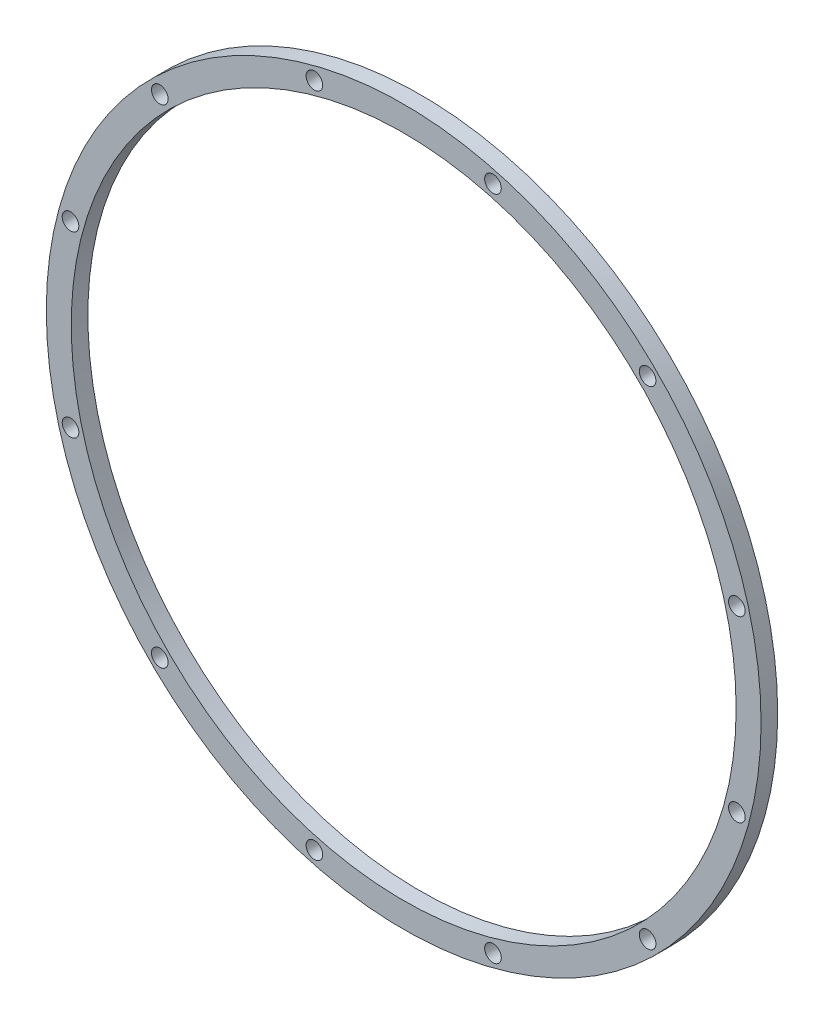
ISO-10303-21;
HEADER;
FILE_DESCRIPTION(('STEP AP214'),'2;1');
FILE_NAME('part.step','',(''),(''),'','','');
FILE_SCHEMA(('AUTOMOTIVE_DESIGN { 1 0 10303 214 1 1 1 1 }'));
ENDSEC;
DATA;
#1=APPLICATION_CONTEXT('core data for automotive mechanical design processes');
#2=APPLICATION_PROTOCOL_DEFINITION('international standard','automotive_design',2000,#1);
#3=PRODUCT_CONTEXT('',#1,'mechanical');
#4=PRODUCT('Part','Part','',(#3));
#5=PRODUCT_RELATED_PRODUCT_CATEGORY('part','',(#4));
#6=PRODUCT_DEFINITION_FORMATION('','',#4);
#7=PRODUCT_DEFINITION_CONTEXT('part definition',#1,'design');
#8=PRODUCT_DEFINITION('design','',#6,#7);
#9=PRODUCT_DEFINITION_SHAPE('','',#8);
#10=(LENGTH_UNIT() NAMED_UNIT(*) SI_UNIT(.MILLI.,.METRE.));
#11=(NAMED_UNIT(*) PLANE_ANGLE_UNIT() SI_UNIT($,.RADIAN.));
#12=(NAMED_UNIT(*) SI_UNIT($,.STERADIAN.) SOLID_ANGLE_UNIT());
#13=UNCERTAINTY_MEASURE_WITH_UNIT(LENGTH_MEASURE(1.E-05),#10,'distance_accuracy_value','');
#14=(GEOMETRIC_REPRESENTATION_CONTEXT(3) GLOBAL_UNCERTAINTY_ASSIGNED_CONTEXT((#13)) GLOBAL_UNIT_ASSIGNED_CONTEXT((#10,
#11,#12)) REPRESENTATION_CONTEXT('',''));
#15=CARTESIAN_POINT('',(0.,0.,0.));
#16=DIRECTION('',(0.,0.,1.));
#17=DIRECTION('',(1.,0.,0.));
#18=AXIS2_PLACEMENT_3D('',#15,#16,#17);
#19=CARTESIAN_POINT('',(0.,0.,25.4000508001016));
#20=DIRECTION('',(0.,0.,1.));
#21=DIRECTION('',(1.,0.,0.));
#22=AXIS2_PLACEMENT_3D('',#19,#20,#21);
#23=PLANE('',#22);
#24=CARTESIAN_POINT('',(136.410860404003,509.092261731953,25.4000508001016));
#25=DIRECTION('',(0.,0.,1.));
#26=DIRECTION('',(0.866025403784445,-0.499999999999989,0.));
#27=AXIS2_PLACEMENT_3D('',#24,#25,#26);
#28=CIRCLE('',#27,12.7);
#29=CARTESIAN_POINT('',(147.409383032066,502.742261731953,25.4000508001016));
#30=VERTEX_POINT('',#29);
#31=EDGE_CURVE('E62',#30,#30,#28,.T.);
#32=ORIENTED_EDGE('',*,*,#31,.F.);
#33=EDGE_LOOP('',(#32));
#34=FACE_BOUND('',#33,.T.);
#35=CARTESIAN_POINT('',(372.681401327936,372.681401327946,25.4000508001016));
#36=DIRECTION('',(0.,0.,1.));
#37=DIRECTION('',(0.50000000000001,-0.866025403784433,0.));
#38=AXIS2_PLACEMENT_3D('',#35,#36,#37);
#39=CIRCLE('',#38,12.7);
#40=CARTESIAN_POINT('',(379.031401327937,361.682878699883,25.4000508001016));
#41=VERTEX_POINT('',#40);
#42=EDGE_CURVE('E68',#41,#41,#39,.T.);
#43=ORIENTED_EDGE('',*,*,#42,.F.);
#44=EDGE_LOOP('',(#43));
#45=FACE_BOUND('',#44,.T.);
#46=CARTESIAN_POINT('',(509.09226173195,136.410860404016,25.4000508001016));
#47=DIRECTION('',(0.,0.,1.));
#48=DIRECTION('',(0.,-1.,0.));
#49=AXIS2_PLACEMENT_3D('',#46,#47,#48);
#50=CIRCLE('',#49,12.7);
#51=CARTESIAN_POINT('',(509.09226173195,123.710860404016,25.4000508001016));
#52=VERTEX_POINT('',#51);
#53=EDGE_CURVE('E74',#52,#52,#50,.T.);
#54=ORIENTED_EDGE('',*,*,#53,.F.);
#55=EDGE_LOOP('',(#54));
#56=FACE_BOUND('',#55,.T.);
#57=CARTESIAN_POINT('',(509.092261731953,-136.410860404005,25.4000508001016));
#58=DIRECTION('',(0.,0.,1.));
#59=DIRECTION('',(-0.499999999999992,-0.866025403784443,0.));
#60=AXIS2_PLACEMENT_3D('',#57,#58,#59);
#61=CIRCLE('',#60,12.7);
#62=CARTESIAN_POINT('',(502.742261731953,-147.409383032067,25.4000508001016));
#63=VERTEX_POINT('',#62);
#64=EDGE_CURVE('E80',#63,#63,#61,.T.);
#65=ORIENTED_EDGE('',*,*,#64,.F.);
#66=EDGE_LOOP('',(#65));
#67=FACE_BOUND('',#66,.T.);
#68=CARTESIAN_POINT('',(372.681401327944,-372.681401327938,25.4000508001016));
#69=DIRECTION('',(0.,0.,1.));
#70=DIRECTION('',(-0.866025403784435,-0.500000000000007,0.));
#71=AXIS2_PLACEMENT_3D('',#68,#69,#70);
#72=CIRCLE('',#71,12.7);
#73=CARTESIAN_POINT('',(361.682878699882,-379.031401327938,25.4000508001016));
#74=VERTEX_POINT('',#73);
#75=EDGE_CURVE('E86',#74,#74,#72,.T.);
#76=ORIENTED_EDGE('',*,*,#75,.F.);
#77=EDGE_LOOP('',(#76));
#78=FACE_BOUND('',#77,.T.);
#79=CARTESIAN_POINT('',(136.410860404011,-509.092261731951,25.4000508001016));
#80=DIRECTION('',(0.,0.,1.));
#81=DIRECTION('',(-1.,0.,0.));
#82=AXIS2_PLACEMENT_3D('',#79,#80,#81);
#83=CIRCLE('',#82,12.7);
#84=CARTESIAN_POINT('',(123.710860404011,-509.092261731951,25.4000508001016));
#85=VERTEX_POINT('',#84);
#86=EDGE_CURVE('E92',#85,#85,#83,.T.);
#87=ORIENTED_EDGE('',*,*,#86,.F.);
#88=EDGE_LOOP('',(#87));
#89=FACE_BOUND('',#88,.T.);
#90=CARTESIAN_POINT('',(-136.410860404007,-509.092261731952,25.4000508001016));
#91=DIRECTION('',(0.,0.,1.));
#92=DIRECTION('',(-0.866025403784442,0.499999999999995,0.));
#93=AXIS2_PLACEMENT_3D('',#90,#91,#92);
#94=CIRCLE('',#93,12.7);
#95=CARTESIAN_POINT('',(-147.409383032069,-502.742261731952,25.4000508001016));
#96=VERTEX_POINT('',#95);
#97=EDGE_CURVE('E98',#96,#96,#94,.T.);
#98=ORIENTED_EDGE('',*,*,#97,.F.);
#99=EDGE_LOOP('',(#98));
#100=FACE_BOUND('',#99,.T.);
#101=CARTESIAN_POINT('',(-372.681401327939,-372.681401327943,25.4000508001016));
#102=DIRECTION('',(0.,0.,1.));
#103=DIRECTION('',(-0.500000000000004,0.866025403784436,0.));
#104=AXIS2_PLACEMENT_3D('',#101,#102,#103);
#105=CIRCLE('',#104,12.7);
#106=CARTESIAN_POINT('',(-379.031401327939,-361.682878699881,25.4000508001016));
#107=VERTEX_POINT('',#106);
#108=EDGE_CURVE('E104',#107,#107,#105,.T.);
#109=ORIENTED_EDGE('',*,*,#108,.F.);
#110=EDGE_LOOP('',(#109));
#111=FACE_BOUND('',#110,.T.);
#112=CARTESIAN_POINT('',(-509.092261731951,-136.410860404012,25.4000508001016));
#113=DIRECTION('',(0.,0.,1.));
#114=DIRECTION('',(0.,1.,0.));
#115=AXIS2_PLACEMENT_3D('',#112,#113,#114);
#116=CIRCLE('',#115,12.7);
#117=CARTESIAN_POINT('',(-509.092261731951,-123.710860404012,25.4000508001016));
#118=VERTEX_POINT('',#117);
#119=EDGE_CURVE('E110',#118,#118,#116,.T.);
#120=ORIENTED_EDGE('',*,*,#119,.F.);
#121=EDGE_LOOP('',(#120));
#122=FACE_BOUND('',#121,.T.);
#123=CARTESIAN_POINT('',(-509.092261731952,136.410860404008,25.4000508001016));
#124=DIRECTION('',(0.,0.,1.));
#125=DIRECTION('',(0.499999999999998,0.86602540378444,0.));
#126=AXIS2_PLACEMENT_3D('',#123,#124,#125);
#127=CIRCLE('',#126,12.7);
#128=CARTESIAN_POINT('',(-502.742261731952,147.409383032071,25.4000508001016));
#129=VERTEX_POINT('',#128);
#130=EDGE_CURVE('E116',#129,#129,#127,.T.);
#131=ORIENTED_EDGE('',*,*,#130,.F.);
#132=EDGE_LOOP('',(#131));
#133=FACE_BOUND('',#132,.T.);
#134=CARTESIAN_POINT('',(-372.681401327942,372.68140132794,25.4000508001016));
#135=DIRECTION('',(0.,0.,1.));
#136=DIRECTION('',(0.866025403784438,0.500000000000001,0.));
#137=AXIS2_PLACEMENT_3D('',#134,#135,#136);
#138=CIRCLE('',#137,12.7);
#139=CARTESIAN_POINT('',(-361.682878699879,379.03140132794,25.4000508001016));
#140=VERTEX_POINT('',#139);
#141=EDGE_CURVE('E56',#140,#140,#138,.T.);
#142=ORIENTED_EDGE('',*,*,#141,.F.);
#143=EDGE_LOOP('',(#142));
#144=FACE_BOUND('',#143,.T.);
#145=CARTESIAN_POINT('',(-136.410860404011,509.092261731951,25.4000508001016));
#146=DIRECTION('',(0.,0.,1.));
#147=DIRECTION('',(1.,0.,0.));
#148=AXIS2_PLACEMENT_3D('',#145,#146,#147);
#149=CIRCLE('',#148,12.7);
#150=CARTESIAN_POINT('',(-123.710860404011,509.092261731951,25.4000508001016));
#151=VERTEX_POINT('',#150);
#152=EDGE_CURVE('E50',#151,#151,#149,.T.);
#153=ORIENTED_EDGE('',*,*,#152,.F.);
#154=EDGE_LOOP('',(#153));
#155=FACE_BOUND('',#154,.T.);
#156=CARTESIAN_POINT('',(0.,0.,25.4000508001016));
#157=DIRECTION('',(0.,0.,1.));
#158=DIRECTION('',(1.,0.,0.));
#159=AXIS2_PLACEMENT_3D('',#156,#157,#158);
#160=CIRCLE('',#159,546.101092202185);
#161=CARTESIAN_POINT('',(546.101092202185,0.,25.4000508001016));
#162=VERTEX_POINT('',#161);
#163=EDGE_CURVE('E10',#162,#162,#160,.T.);
#164=ORIENTED_EDGE('',*,*,#163,.T.);
#165=EDGE_LOOP('',(#164));
#166=FACE_BOUND('',#165,.T.);
#167=CARTESIAN_POINT('',(0.,0.,25.4000508001016));
#168=DIRECTION('',(0.,0.,1.));
#169=DIRECTION('',(1.,0.,0.));
#170=AXIS2_PLACEMENT_3D('',#167,#168,#169);
#171=CIRCLE('',#170,508.001016002032);
#172=CARTESIAN_POINT('',(508.001016002032,0.,25.4000508001016));
#173=VERTEX_POINT('',#172);
#174=EDGE_CURVE('E42',#173,#173,#171,.T.);
#175=ORIENTED_EDGE('',*,*,#174,.F.);
#176=EDGE_LOOP('',(#175));
#177=FACE_BOUND('',#176,.T.);
#178=ADVANCED_FACE('F31',(#34,#45,#56,#67,#78,#89,#100,#111,#122,#133,#144,#155,#166,#177),#23,.T.);
#179=CARTESIAN_POINT('',(0.,0.,0.));
#180=DIRECTION('',(0.,0.,1.));
#181=DIRECTION('',(1.,0.,0.));
#182=AXIS2_PLACEMENT_3D('',#179,#180,#181);
#183=PLANE('',#182);
#184=CARTESIAN_POINT('',(136.410860404003,509.092261731953,0.));
#185=DIRECTION('',(0.,0.,1.));
#186=DIRECTION('',(0.866025403784445,-0.499999999999989,0.));
#187=AXIS2_PLACEMENT_3D('',#184,#185,#186);
#188=CIRCLE('',#187,12.7);
#189=CARTESIAN_POINT('',(147.409383032066,502.742261731953,0.));
#190=VERTEX_POINT('',#189);
#191=EDGE_CURVE('E65',#190,#190,#188,.T.);
#192=ORIENTED_EDGE('',*,*,#191,.T.);
#193=EDGE_LOOP('',(#192));
#194=FACE_BOUND('',#193,.T.);
#195=CARTESIAN_POINT('',(372.681401327936,372.681401327946,0.));
#196=DIRECTION('',(0.,0.,1.));
#197=DIRECTION('',(0.50000000000001,-0.866025403784433,0.));
#198=AXIS2_PLACEMENT_3D('',#195,#196,#197);
#199=CIRCLE('',#198,12.7);
#200=CARTESIAN_POINT('',(379.031401327937,361.682878699883,0.));
#201=VERTEX_POINT('',#200);
#202=EDGE_CURVE('E71',#201,#201,#199,.T.);
#203=ORIENTED_EDGE('',*,*,#202,.T.);
#204=EDGE_LOOP('',(#203));
#205=FACE_BOUND('',#204,.T.);
#206=CARTESIAN_POINT('',(509.09226173195,136.410860404016,0.));
#207=DIRECTION('',(0.,0.,1.));
#208=DIRECTION('',(0.,-1.,0.));
#209=AXIS2_PLACEMENT_3D('',#206,#207,#208);
#210=CIRCLE('',#209,12.7);
#211=CARTESIAN_POINT('',(509.09226173195,123.710860404016,0.));
#212=VERTEX_POINT('',#211);
#213=EDGE_CURVE('E77',#212,#212,#210,.T.);
#214=ORIENTED_EDGE('',*,*,#213,.T.);
#215=EDGE_LOOP('',(#214));
#216=FACE_BOUND('',#215,.T.);
#217=CARTESIAN_POINT('',(509.092261731953,-136.410860404005,0.));
#218=DIRECTION('',(0.,0.,1.));
#219=DIRECTION('',(-0.499999999999992,-0.866025403784443,0.));
#220=AXIS2_PLACEMENT_3D('',#217,#218,#219);
#221=CIRCLE('',#220,12.7);
#222=CARTESIAN_POINT('',(502.742261731953,-147.409383032067,0.));
#223=VERTEX_POINT('',#222);
#224=EDGE_CURVE('E83',#223,#223,#221,.T.);
#225=ORIENTED_EDGE('',*,*,#224,.T.);
#226=EDGE_LOOP('',(#225));
#227=FACE_BOUND('',#226,.T.);
#228=CARTESIAN_POINT('',(372.681401327944,-372.681401327938,0.));
#229=DIRECTION('',(0.,0.,1.));
#230=DIRECTION('',(-0.866025403784435,-0.500000000000007,0.));
#231=AXIS2_PLACEMENT_3D('',#228,#229,#230);
#232=CIRCLE('',#231,12.7);
#233=CARTESIAN_POINT('',(361.682878699882,-379.031401327938,0.));
#234=VERTEX_POINT('',#233);
#235=EDGE_CURVE('E89',#234,#234,#232,.T.);
#236=ORIENTED_EDGE('',*,*,#235,.T.);
#237=EDGE_LOOP('',(#236));
#238=FACE_BOUND('',#237,.T.);
#239=CARTESIAN_POINT('',(136.410860404011,-509.092261731951,0.));
#240=DIRECTION('',(0.,0.,1.));
#241=DIRECTION('',(-1.,0.,0.));
#242=AXIS2_PLACEMENT_3D('',#239,#240,#241);
#243=CIRCLE('',#242,12.7);
#244=CARTESIAN_POINT('',(123.710860404011,-509.092261731951,0.));
#245=VERTEX_POINT('',#244);
#246=EDGE_CURVE('E95',#245,#245,#243,.T.);
#247=ORIENTED_EDGE('',*,*,#246,.T.);
#248=EDGE_LOOP('',(#247));
#249=FACE_BOUND('',#248,.T.);
#250=CARTESIAN_POINT('',(-136.410860404007,-509.092261731952,0.));
#251=DIRECTION('',(0.,0.,1.));
#252=DIRECTION('',(-0.866025403784442,0.499999999999995,0.));
#253=AXIS2_PLACEMENT_3D('',#250,#251,#252);
#254=CIRCLE('',#253,12.7);
#255=CARTESIAN_POINT('',(-147.409383032069,-502.742261731952,0.));
#256=VERTEX_POINT('',#255);
#257=EDGE_CURVE('E101',#256,#256,#254,.T.);
#258=ORIENTED_EDGE('',*,*,#257,.T.);
#259=EDGE_LOOP('',(#258));
#260=FACE_BOUND('',#259,.T.);
#261=CARTESIAN_POINT('',(-372.681401327939,-372.681401327943,0.));
#262=DIRECTION('',(0.,0.,1.));
#263=DIRECTION('',(-0.500000000000004,0.866025403784436,0.));
#264=AXIS2_PLACEMENT_3D('',#261,#262,#263);
#265=CIRCLE('',#264,12.7);
#266=CARTESIAN_POINT('',(-379.031401327939,-361.682878699881,0.));
#267=VERTEX_POINT('',#266);
#268=EDGE_CURVE('E107',#267,#267,#265,.T.);
#269=ORIENTED_EDGE('',*,*,#268,.T.);
#270=EDGE_LOOP('',(#269));
#271=FACE_BOUND('',#270,.T.);
#272=CARTESIAN_POINT('',(-509.092261731951,-136.410860404012,0.));
#273=DIRECTION('',(0.,0.,1.));
#274=DIRECTION('',(0.,1.,0.));
#275=AXIS2_PLACEMENT_3D('',#272,#273,#274);
#276=CIRCLE('',#275,12.7);
#277=CARTESIAN_POINT('',(-509.092261731951,-123.710860404012,0.));
#278=VERTEX_POINT('',#277);
#279=EDGE_CURVE('E113',#278,#278,#276,.T.);
#280=ORIENTED_EDGE('',*,*,#279,.T.);
#281=EDGE_LOOP('',(#280));
#282=FACE_BOUND('',#281,.T.);
#283=CARTESIAN_POINT('',(-509.092261731952,136.410860404008,0.));
#284=DIRECTION('',(0.,0.,1.));
#285=DIRECTION('',(0.499999999999998,0.86602540378444,0.));
#286=AXIS2_PLACEMENT_3D('',#283,#284,#285);
#287=CIRCLE('',#286,12.7);
#288=CARTESIAN_POINT('',(-502.742261731952,147.409383032071,0.));
#289=VERTEX_POINT('',#288);
#290=EDGE_CURVE('E59',#289,#289,#287,.T.);
#291=ORIENTED_EDGE('',*,*,#290,.T.);
#292=EDGE_LOOP('',(#291));
#293=FACE_BOUND('',#292,.T.);
#294=CARTESIAN_POINT('',(-372.681401327942,372.68140132794,0.));
#295=DIRECTION('',(0.,0.,1.));
#296=DIRECTION('',(0.866025403784438,0.500000000000001,0.));
#297=AXIS2_PLACEMENT_3D('',#294,#295,#296);
#298=CIRCLE('',#297,12.7);
#299=CARTESIAN_POINT('',(-361.682878699879,379.03140132794,0.));
#300=VERTEX_POINT('',#299);
#301=EDGE_CURVE('E53',#300,#300,#298,.T.);
#302=ORIENTED_EDGE('',*,*,#301,.T.);
#303=EDGE_LOOP('',(#302));
#304=FACE_BOUND('',#303,.T.);
#305=CARTESIAN_POINT('',(-136.410860404011,509.092261731951,0.));
#306=DIRECTION('',(0.,0.,1.));
#307=DIRECTION('',(1.,0.,0.));
#308=AXIS2_PLACEMENT_3D('',#305,#306,#307);
#309=CIRCLE('',#308,12.7);
#310=CARTESIAN_POINT('',(-123.710860404011,509.092261731951,0.));
#311=VERTEX_POINT('',#310);
#312=EDGE_CURVE('E47',#311,#311,#309,.T.);
#313=ORIENTED_EDGE('',*,*,#312,.T.);
#314=EDGE_LOOP('',(#313));
#315=FACE_BOUND('',#314,.T.);
#316=CARTESIAN_POINT('',(0.,0.,0.));
#317=DIRECTION('',(0.,0.,1.));
#318=DIRECTION('',(1.,0.,0.));
#319=AXIS2_PLACEMENT_3D('',#316,#317,#318);
#320=CIRCLE('',#319,546.101092202185);
#321=CARTESIAN_POINT('',(546.101092202185,0.,0.));
#322=VERTEX_POINT('',#321);
#323=EDGE_CURVE('E35',#322,#322,#320,.T.);
#324=ORIENTED_EDGE('',*,*,#323,.F.);
#325=EDGE_LOOP('',(#324));
#326=FACE_BOUND('',#325,.T.);
#327=CARTESIAN_POINT('',(0.,0.,0.));
#328=DIRECTION('',(0.,0.,1.));
#329=DIRECTION('',(1.,0.,0.));
#330=AXIS2_PLACEMENT_3D('',#327,#328,#329);
#331=CIRCLE('',#330,508.001016002032);
#332=CARTESIAN_POINT('',(508.001016002032,0.,0.));
#333=VERTEX_POINT('',#332);
#334=EDGE_CURVE('E44',#333,#333,#331,.T.);
#335=ORIENTED_EDGE('',*,*,#334,.T.);
#336=EDGE_LOOP('',(#335));
#337=FACE_BOUND('',#336,.T.);
#338=ADVANCED_FACE('F122',(#194,#205,#216,#227,#238,#249,#260,#271,#282,#293,#304,#315,#326,
#337),#183,.F.);
#339=CARTESIAN_POINT('',(0.,0.,25.4000508001016));
#340=DIRECTION('',(0.,0.,-1.));
#341=DIRECTION('',(-1.,0.,0.));
#342=AXIS2_PLACEMENT_3D('',#339,#340,#341);
#343=CYLINDRICAL_SURFACE('',#342,546.101092202185);
#344=ORIENTED_EDGE('',*,*,#163,.F.);
#345=EDGE_LOOP('',(#344));
#346=FACE_BOUND('',#345,.T.);
#347=ORIENTED_EDGE('',*,*,#323,.T.);
#348=EDGE_LOOP('',(#347));
#349=FACE_BOUND('',#348,.T.);
#350=ADVANCED_FACE('F33',(#346,#349),#343,.T.);
#351=CARTESIAN_POINT('',(0.,0.,25.4000508001016));
#352=DIRECTION('',(0.,0.,-1.));
#353=DIRECTION('',(-1.,0.,0.));
#354=AXIS2_PLACEMENT_3D('',#351,#352,#353);
#355=CYLINDRICAL_SURFACE('',#354,508.001016002032);
#356=ORIENTED_EDGE('',*,*,#174,.T.);
#357=EDGE_LOOP('',(#356));
#358=FACE_BOUND('',#357,.T.);
#359=ORIENTED_EDGE('',*,*,#334,.F.);
#360=EDGE_LOOP('',(#359));
#361=FACE_BOUND('',#360,.T.);
#362=ADVANCED_FACE('F143',(#358,#361),#355,.F.);
#363=CARTESIAN_POINT('',(-136.410860404011,509.092261731951,0.));
#364=DIRECTION('',(0.,0.,1.));
#365=DIRECTION('',(1.,0.,0.));
#366=AXIS2_PLACEMENT_3D('',#363,#364,#365);
#367=CYLINDRICAL_SURFACE('',#366,12.7);
#368=ORIENTED_EDGE('',*,*,#312,.F.);
#369=EDGE_LOOP('',(#368));
#370=FACE_BOUND('',#369,.T.);
#371=ORIENTED_EDGE('',*,*,#152,.T.);
#372=EDGE_LOOP('',(#371));
#373=FACE_BOUND('',#372,.T.);
#374=ADVANCED_FACE('F146',(#370,#373),#367,.F.);
#375=CARTESIAN_POINT('',(-372.681401327942,372.68140132794,0.));
#376=DIRECTION('',(0.,0.,1.));
#377=DIRECTION('',(1.,0.,0.));
#378=AXIS2_PLACEMENT_3D('',#375,#376,#377);
#379=CYLINDRICAL_SURFACE('',#378,12.7);
#380=ORIENTED_EDGE('',*,*,#301,.F.);
#381=EDGE_LOOP('',(#380));
#382=FACE_BOUND('',#381,.T.);
#383=ORIENTED_EDGE('',*,*,#141,.T.);
#384=EDGE_LOOP('',(#383));
#385=FACE_BOUND('',#384,.T.);
#386=ADVANCED_FACE('F129',(#382,#385),#379,.F.);
#387=CARTESIAN_POINT('',(-509.092261731952,136.410860404008,0.));
#388=DIRECTION('',(0.,0.,1.));
#389=DIRECTION('',(1.,0.,0.));
#390=AXIS2_PLACEMENT_3D('',#387,#388,#389);
#391=CYLINDRICAL_SURFACE('',#390,12.7);
#392=ORIENTED_EDGE('',*,*,#290,.F.);
#393=EDGE_LOOP('',(#392));
#394=FACE_BOUND('',#393,.T.);
#395=ORIENTED_EDGE('',*,*,#130,.T.);
#396=EDGE_LOOP('',(#395));
#397=FACE_BOUND('',#396,.T.);
#398=ADVANCED_FACE('F125',(#394,#397),#391,.F.);
#399=CARTESIAN_POINT('',(-509.092261731951,-136.410860404012,0.));
#400=DIRECTION('',(0.,0.,1.));
#401=DIRECTION('',(1.,0.,0.));
#402=AXIS2_PLACEMENT_3D('',#399,#400,#401);
#403=CYLINDRICAL_SURFACE('',#402,12.7);
#404=ORIENTED_EDGE('',*,*,#279,.F.);
#405=EDGE_LOOP('',(#404));
#406=FACE_BOUND('',#405,.T.);
#407=ORIENTED_EDGE('',*,*,#119,.T.);
#408=EDGE_LOOP('',(#407));
#409=FACE_BOUND('',#408,.T.);
#410=ADVANCED_FACE('F128',(#406,#409),#403,.F.);
#411=CARTESIAN_POINT('',(-372.681401327939,-372.681401327943,0.));
#412=DIRECTION('',(0.,0.,1.));
#413=DIRECTION('',(1.,0.,0.));
#414=AXIS2_PLACEMENT_3D('',#411,#412,#413);
#415=CYLINDRICAL_SURFACE('',#414,12.7);
#416=ORIENTED_EDGE('',*,*,#268,.F.);
#417=EDGE_LOOP('',(#416));
#418=FACE_BOUND('',#417,.T.);
#419=ORIENTED_EDGE('',*,*,#108,.T.);
#420=EDGE_LOOP('',(#419));
#421=FACE_BOUND('',#420,.T.);
#422=ADVANCED_FACE('F191',(#418,#421),#415,.F.);
#423=CARTESIAN_POINT('',(-136.410860404007,-509.092261731952,0.));
#424=DIRECTION('',(0.,0.,1.));
#425=DIRECTION('',(1.,0.,0.));
#426=AXIS2_PLACEMENT_3D('',#423,#424,#425);
#427=CYLINDRICAL_SURFACE('',#426,12.7);
#428=ORIENTED_EDGE('',*,*,#257,.F.);
#429=EDGE_LOOP('',(#428));
#430=FACE_BOUND('',#429,.T.);
#431=ORIENTED_EDGE('',*,*,#97,.T.);
#432=EDGE_LOOP('',(#431));
#433=FACE_BOUND('',#432,.T.);
#434=ADVANCED_FACE('F187',(#430,#433),#427,.F.);
#435=CARTESIAN_POINT('',(136.410860404011,-509.092261731951,0.));
#436=DIRECTION('',(0.,0.,1.));
#437=DIRECTION('',(1.,0.,0.));
#438=AXIS2_PLACEMENT_3D('',#435,#436,#437);
#439=CYLINDRICAL_SURFACE('',#438,12.7);
#440=ORIENTED_EDGE('',*,*,#246,.F.);
#441=EDGE_LOOP('',(#440));
#442=FACE_BOUND('',#441,.T.);
#443=ORIENTED_EDGE('',*,*,#86,.T.);
#444=EDGE_LOOP('',(#443));
#445=FACE_BOUND('',#444,.T.);
#446=ADVANCED_FACE('F183',(#442,#445),#439,.F.);
#447=CARTESIAN_POINT('',(372.681401327944,-372.681401327938,0.));
#448=DIRECTION('',(0.,0.,1.));
#449=DIRECTION('',(1.,0.,0.));
#450=AXIS2_PLACEMENT_3D('',#447,#448,#449);
#451=CYLINDRICAL_SURFACE('',#450,12.7);
#452=ORIENTED_EDGE('',*,*,#235,.F.);
#453=EDGE_LOOP('',(#452));
#454=FACE_BOUND('',#453,.T.);
#455=ORIENTED_EDGE('',*,*,#75,.T.);
#456=EDGE_LOOP('',(#455));
#457=FACE_BOUND('',#456,.T.);
#458=ADVANCED_FACE('F179',(#454,#457),#451,.F.);
#459=CARTESIAN_POINT('',(509.092261731953,-136.410860404005,0.));
#460=DIRECTION('',(0.,0.,1.));
#461=DIRECTION('',(1.,0.,0.));
#462=AXIS2_PLACEMENT_3D('',#459,#460,#461);
#463=CYLINDRICAL_SURFACE('',#462,12.7);
#464=ORIENTED_EDGE('',*,*,#224,.F.);
#465=EDGE_LOOP('',(#464));
#466=FACE_BOUND('',#465,.T.);
#467=ORIENTED_EDGE('',*,*,#64,.T.);
#468=EDGE_LOOP('',(#467));
#469=FACE_BOUND('',#468,.T.);
#470=ADVANCED_FACE('F175',(#466,#469),#463,.F.);
#471=CARTESIAN_POINT('',(509.09226173195,136.410860404016,0.));
#472=DIRECTION('',(0.,0.,1.));
#473=DIRECTION('',(1.,0.,0.));
#474=AXIS2_PLACEMENT_3D('',#471,#472,#473);
#475=CYLINDRICAL_SURFACE('',#474,12.7);
#476=ORIENTED_EDGE('',*,*,#213,.F.);
#477=EDGE_LOOP('',(#476));
#478=FACE_BOUND('',#477,.T.);
#479=ORIENTED_EDGE('',*,*,#53,.T.);
#480=EDGE_LOOP('',(#479));
#481=FACE_BOUND('',#480,.T.);
#482=ADVANCED_FACE('F171',(#478,#481),#475,.F.);
#483=CARTESIAN_POINT('',(372.681401327936,372.681401327946,0.));
#484=DIRECTION('',(0.,0.,1.));
#485=DIRECTION('',(1.,0.,0.));
#486=AXIS2_PLACEMENT_3D('',#483,#484,#485);
#487=CYLINDRICAL_SURFACE('',#486,12.7);
#488=ORIENTED_EDGE('',*,*,#202,.F.);
#489=EDGE_LOOP('',(#488));
#490=FACE_BOUND('',#489,.T.);
#491=ORIENTED_EDGE('',*,*,#42,.T.);
#492=EDGE_LOOP('',(#491));
#493=FACE_BOUND('',#492,.T.);
#494=ADVANCED_FACE('F167',(#490,#493),#487,.F.);
#495=CARTESIAN_POINT('',(136.410860404003,509.092261731953,0.));
#496=DIRECTION('',(0.,0.,1.));
#497=DIRECTION('',(1.,0.,0.));
#498=AXIS2_PLACEMENT_3D('',#495,#496,#497);
#499=CYLINDRICAL_SURFACE('',#498,12.7);
#500=ORIENTED_EDGE('',*,*,#191,.F.);
#501=EDGE_LOOP('',(#500));
#502=FACE_BOUND('',#501,.T.);
#503=ORIENTED_EDGE('',*,*,#31,.T.);
#504=EDGE_LOOP('',(#503));
#505=FACE_BOUND('',#504,.T.);
#506=ADVANCED_FACE('F164',(#502,#505),#499,.F.);
#507=CLOSED_SHELL('',(#178,#338,#350,#362,#374,#386,#398,#410,#422,#434,#446,#458,#470,#482,
#494,#506));
#508=MANIFOLD_SOLID_BREP('B2',#507);
#509=ADVANCED_BREP_SHAPE_REPRESENTATION('',(#18,#508),#14);
#510=SHAPE_DEFINITION_REPRESENTATION(#9,#509);
ENDSEC;
END-ISO-10303-21;
